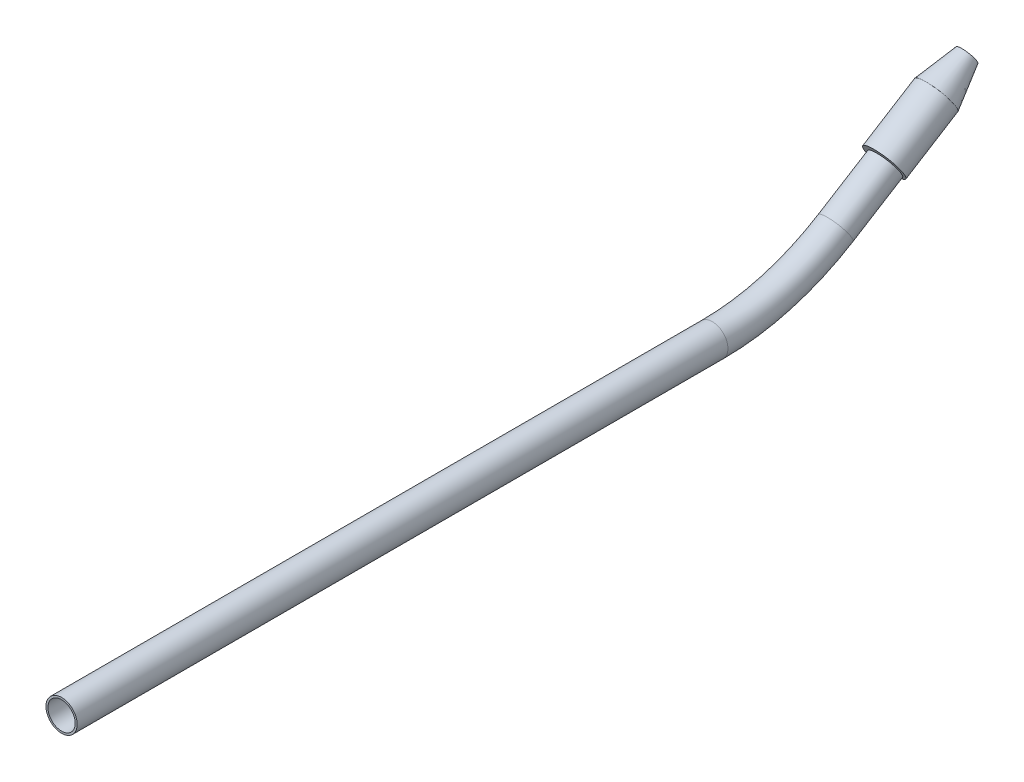
ISO-10303-21;
HEADER;
FILE_DESCRIPTION(('STEP AP214'),'2;1');
FILE_NAME('part.step','',(''),(''),'','','');
FILE_SCHEMA(('AUTOMOTIVE_DESIGN { 1 0 10303 214 1 1 1 1 }'));
ENDSEC;
DATA;
#1=APPLICATION_CONTEXT('core data for automotive mechanical design processes');
#2=APPLICATION_PROTOCOL_DEFINITION('international standard','automotive_design',2000,#1);
#3=PRODUCT_CONTEXT('',#1,'mechanical');
#4=PRODUCT('Part','Part','',(#3));
#5=PRODUCT_RELATED_PRODUCT_CATEGORY('part','',(#4));
#6=PRODUCT_DEFINITION_FORMATION('','',#4);
#7=PRODUCT_DEFINITION_CONTEXT('part definition',#1,'design');
#8=PRODUCT_DEFINITION('design','',#6,#7);
#9=PRODUCT_DEFINITION_SHAPE('','',#8);
#10=(LENGTH_UNIT() NAMED_UNIT(*) SI_UNIT(.MILLI.,.METRE.));
#11=(NAMED_UNIT(*) PLANE_ANGLE_UNIT() SI_UNIT($,.RADIAN.));
#12=(NAMED_UNIT(*) SI_UNIT($,.STERADIAN.) SOLID_ANGLE_UNIT());
#13=UNCERTAINTY_MEASURE_WITH_UNIT(LENGTH_MEASURE(1.E-05),#10,'distance_accuracy_value','');
#14=(GEOMETRIC_REPRESENTATION_CONTEXT(3) GLOBAL_UNCERTAINTY_ASSIGNED_CONTEXT((#13)) GLOBAL_UNIT_ASSIGNED_CONTEXT((#10,
#11,#12)) REPRESENTATION_CONTEXT('',''));
#15=CARTESIAN_POINT('',(0.,0.,0.));
#16=DIRECTION('',(0.,0.,1.));
#17=DIRECTION('',(1.,0.,0.));
#18=AXIS2_PLACEMENT_3D('',#15,#16,#17);
#19=CARTESIAN_POINT('',(0.,-57.1210339456504,7.82934113979381));
#20=DIRECTION('',(0.,-0.528906522491914,0.848680087232822));
#21=DIRECTION('',(0.,-0.848680087232822,-0.528906522491914));
#22=AXIS2_PLACEMENT_3D('',#19,#20,#21);
#23=CYLINDRICAL_SURFACE('',#22,0.62499881796374);
#24=CARTESIAN_POINT('',(0.,8.66642229513749,-97.7327983441465));
#25=DIRECTION('',(0.,-0.528906522491914,0.848680087232822));
#26=DIRECTION('',(0.,-0.848680087232822,-0.528906522491914));
#27=AXIS2_PLACEMENT_3D('',#24,#25,#26);
#28=CIRCLE('',#27,0.62499881796374);
#29=CARTESIAN_POINT('',(0.,8.13599824378761,-98.0633642955173));
#30=VERTEX_POINT('',#29);
#31=EDGE_CURVE('E12',#30,#30,#28,.T.);
#32=ORIENTED_EDGE('',*,*,#31,.T.);
#33=EDGE_LOOP('',(#32));
#34=FACE_BOUND('',#33,.T.);
#35=CARTESIAN_POINT('',(0.,15.2796700478453,-108.344374191646));
#36=DIRECTION('',(0.,-0.528906522491914,0.848680087232822));
#37=DIRECTION('',(0.,-0.848680087232822,-0.528906522491914));
#38=AXIS2_PLACEMENT_3D('',#35,#36,#37);
#39=CIRCLE('',#38,0.624998817963733);
#40=CARTESIAN_POINT('',(0.,14.7492459964954,-108.674940143017));
#41=VERTEX_POINT('',#40);
#42=EDGE_CURVE('E62',#41,#41,#39,.T.);
#43=ORIENTED_EDGE('',*,*,#42,.F.);
#44=EDGE_LOOP('',(#43));
#45=FACE_BOUND('',#44,.T.);
#46=ADVANCED_FACE('F43',(#34,#45),#23,.F.);
#47=CARTESIAN_POINT('',(0.,8.13599824378762,-98.0633642955173));
#48=DIRECTION('',(0.,-0.528906522491914,0.848680087232822));
#49=DIRECTION('',(0.,-0.848680087232822,-0.528906522491914));
#50=AXIS2_PLACEMENT_3D('',#47,#48,#49);
#51=PLANE('',#50);
#52=CARTESIAN_POINT('',(0.,8.66642229513749,-97.7327983441465));
#53=DIRECTION('',(0.,-0.528906522491914,0.848680087232822));
#54=DIRECTION('',(0.,-0.848680087232822,-0.528906522491914));
#55=AXIS2_PLACEMENT_3D('',#52,#53,#54);
#56=CIRCLE('',#55,2.47568441904904);
#57=CARTESIAN_POINT('',(0.,6.56535822641802,-99.0422039810132));
#58=VERTEX_POINT('',#57);
#59=EDGE_CURVE('E49',#58,#58,#56,.T.);
#60=ORIENTED_EDGE('',*,*,#59,.T.);
#61=EDGE_LOOP('',(#60));
#62=FACE_BOUND('',#61,.T.);
#63=ORIENTED_EDGE('',*,*,#31,.F.);
#64=EDGE_LOOP('',(#63));
#65=FACE_BOUND('',#64,.T.);
#66=ADVANCED_FACE('F70',(#62,#65),#51,.T.);
#67=CARTESIAN_POINT('',(0.,-57.1210339456504,7.82934113979381));
#68=DIRECTION('',(0.,-0.528906522491914,0.848680087232822));
#69=DIRECTION('',(0.,-0.848680087232822,-0.528906522491914));
#70=AXIS2_PLACEMENT_3D('',#67,#68,#69);
#71=CYLINDRICAL_SURFACE('',#70,2.47568441904904);
#72=CARTESIAN_POINT('',(0.,12.8264354405282,-104.407929334186));
#73=DIRECTION('',(0.,-0.528906522491914,0.848680087232822));
#74=DIRECTION('',(0.,-0.848680087232822,-0.528906522491914));
#75=AXIS2_PLACEMENT_3D('',#72,#73,#74);
#76=CIRCLE('',#75,2.47568441904905);
#77=CARTESIAN_POINT('',(0.,10.7253713718087,-105.717334971053));
#78=VERTEX_POINT('',#77);
#79=EDGE_CURVE('E53',#78,#78,#76,.T.);
#80=ORIENTED_EDGE('',*,*,#79,.T.);
#81=EDGE_LOOP('',(#80));
#82=FACE_BOUND('',#81,.T.);
#83=ORIENTED_EDGE('',*,*,#59,.F.);
#84=EDGE_LOOP('',(#83));
#85=FACE_BOUND('',#84,.T.);
#86=ADVANCED_FACE('F74',(#82,#85),#71,.T.);
#87=CARTESIAN_POINT('',(0.,12.8264354405282,-104.407929334186));
#88=DIRECTION('',(0.,-0.528906522491914,0.848680087232822));
#89=DIRECTION('',(0.,-0.848680087232822,-0.528906522491914));
#90=AXIS2_PLACEMENT_3D('',#87,#88,#89);
#91=CONICAL_SURFACE('',#90,2.47568441904904,0.258399369340229);
#92=CARTESIAN_POINT('',(0.,15.2796700478453,-108.344374191646));
#93=DIRECTION('',(0.,-0.528906522491914,0.848680087232822));
#94=DIRECTION('',(0.,-0.848680087232822,-0.528906522491914));
#95=AXIS2_PLACEMENT_3D('',#92,#93,#94);
#96=CIRCLE('',#95,1.24973918269446);
#97=CARTESIAN_POINT('',(0.,14.2190412892579,-109.005369396787));
#98=VERTEX_POINT('',#97);
#99=EDGE_CURVE('E57',#98,#98,#96,.T.);
#100=ORIENTED_EDGE('',*,*,#99,.T.);
#101=EDGE_LOOP('',(#100));
#102=FACE_BOUND('',#101,.T.);
#103=ORIENTED_EDGE('',*,*,#79,.F.);
#104=EDGE_LOOP('',(#103));
#105=FACE_BOUND('',#104,.T.);
#106=ADVANCED_FACE('F78',(#102,#105),#91,.T.);
#107=CARTESIAN_POINT('',(0.,14.2190412892579,-109.005369396787));
#108=DIRECTION('',(0.,0.528906522491914,-0.848680087232822));
#109=DIRECTION('',(0.,0.848680087232822,0.528906522491914));
#110=AXIS2_PLACEMENT_3D('',#107,#108,#109);
#111=PLANE('',#110);
#112=ORIENTED_EDGE('',*,*,#42,.T.);
#113=EDGE_LOOP('',(#112));
#114=FACE_BOUND('',#113,.T.);
#115=ORIENTED_EDGE('',*,*,#99,.F.);
#116=EDGE_LOOP('',(#115));
#117=FACE_BOUND('',#116,.T.);
#118=ADVANCED_FACE('F66',(#114,#117),#111,.T.);
#119=CLOSED_SHELL('',(#46,#66,#86,#106,#118));
#120=MANIFOLD_SOLID_BREP('B2',#119);
#121=CARTESIAN_POINT('',(0.,0.,7.82934113979381));
#122=DIRECTION('',(0.,0.,-1.));
#123=DIRECTION('',(0.,1.,0.));
#124=AXIS2_PLACEMENT_3D('',#121,#122,#123);
#125=CYLINDRICAL_SURFACE('',#124,2.);
#126=CARTESIAN_POINT('',(0.,0.,-75.6736475066552));
#127=DIRECTION('',(0.,0.,1.));
#128=DIRECTION('',(1.,0.,0.));
#129=AXIS2_PLACEMENT_3D('',#126,#127,#128);
#130=CIRCLE('',#129,2.);
#131=CARTESIAN_POINT('',(0.,-1.99999999999999,-75.6736475066552));
#132=VERTEX_POINT('',#131);
#133=EDGE_CURVE('E142',#132,#132,#130,.T.);
#134=ORIENTED_EDGE('',*,*,#133,.T.);
#135=EDGE_LOOP('',(#134));
#136=FACE_BOUND('',#135,.T.);
#137=CARTESIAN_POINT('',(0.,0.,7.82934113979381));
#138=DIRECTION('',(0.,0.,1.));
#139=DIRECTION('',(1.,0.,0.));
#140=AXIS2_PLACEMENT_3D('',#137,#138,#139);
#141=CIRCLE('',#140,2.);
#142=CARTESIAN_POINT('',(2.,0.,7.82934113979381));
#143=VERTEX_POINT('',#142);
#144=EDGE_CURVE('E140',#143,#143,#141,.T.);
#145=ORIENTED_EDGE('',*,*,#144,.F.);
#146=EDGE_LOOP('',(#145));
#147=FACE_BOUND('',#146,.T.);
#148=ADVANCED_FACE('F119',(#136,#147),#125,.T.);
#149=CARTESIAN_POINT('',(0.,30.,-75.6736475066553));
#150=DIRECTION('',(1.,0.,0.));
#151=DIRECTION('',(0.,0.,-1.));
#152=AXIS2_PLACEMENT_3D('',#149,#150,#151);
#153=TOROIDAL_SURFACE('',#152,30.,2.);
#154=CARTESIAN_POINT('',(0.,4.50878593052604,-91.4912960444201));
#155=DIRECTION('',(0.,-0.527254951258826,0.849707135649132));
#156=DIRECTION('',(1.,0.,0.));
#157=AXIS2_PLACEMENT_3D('',#154,#155,#156);
#158=CIRCLE('',#157,2.);
#159=CARTESIAN_POINT('',(0.,2.80937165922778,-92.5458059469378));
#160=VERTEX_POINT('',#159);
#161=EDGE_CURVE('E123',#160,#160,#158,.T.);
#162=CARTESIAN_POINT('',(0.,30.,-75.6736475066553));
#163=DIRECTION('',(1.,0.,0.));
#164=DIRECTION('',(0.,0.,-1.));
#165=AXIS2_PLACEMENT_3D('',#162,#163,#164);
#166=CIRCLE('',#165,32.);
#167=EDGE_CURVE('',#132,#160,#166,.T.);
#168=ORIENTED_EDGE('',*,*,#133,.F.);
#169=ORIENTED_EDGE('',*,*,#161,.T.);
#170=ORIENTED_EDGE('',*,*,#167,.T.);
#171=ORIENTED_EDGE('',*,*,#167,.F.);
#172=EDGE_LOOP('',(#168,#170,#169,#171));
#173=FACE_BOUND('',#172,.T.);
#174=ADVANCED_FACE('F149',(#173),#153,.T.);
#175=CARTESIAN_POINT('',(0.,4.50878593052604,-91.4912960444201));
#176=DIRECTION('',(0.,0.527254951258823,-0.849707135649134));
#177=DIRECTION('',(0.,0.849707135649134,0.527254951258823));
#178=AXIS2_PLACEMENT_3D('',#175,#176,#177);
#179=CYLINDRICAL_SURFACE('',#178,2.);
#180=CARTESIAN_POINT('',(0.,8.45112715560377,-97.8446464721677));
#181=DIRECTION('',(0.,-0.527254951258823,0.849707135649134));
#182=DIRECTION('',(1.,0.,0.));
#183=AXIS2_PLACEMENT_3D('',#180,#181,#182);
#184=CIRCLE('',#183,2.);
#185=CARTESIAN_POINT('',(2.,8.45112715560377,-97.8446464721677));
#186=VERTEX_POINT('',#185);
#187=EDGE_CURVE('E136',#186,#186,#184,.T.);
#188=ORIENTED_EDGE('',*,*,#187,.T.);
#189=EDGE_LOOP('',(#188));
#190=FACE_BOUND('',#189,.T.);
#191=ORIENTED_EDGE('',*,*,#161,.F.);
#192=EDGE_LOOP('',(#191));
#193=FACE_BOUND('',#192,.T.);
#194=ADVANCED_FACE('F121',(#190,#193),#179,.T.);
#195=CARTESIAN_POINT('',(0.,0.,7.82934113979381));
#196=DIRECTION('',(0.,0.,1.));
#197=DIRECTION('',(1.,0.,0.));
#198=AXIS2_PLACEMENT_3D('',#195,#196,#197);
#199=PLANE('',#198);
#200=CARTESIAN_POINT('',(0.,0.,7.82934113979381));
#201=DIRECTION('',(0.,0.,1.));
#202=DIRECTION('',(1.,0.,0.));
#203=AXIS2_PLACEMENT_3D('',#200,#201,#202);
#204=CIRCLE('',#203,1.75);
#205=CARTESIAN_POINT('',(1.75,0.,7.82934113979381));
#206=VERTEX_POINT('',#205);
#207=EDGE_CURVE('E139',#206,#206,#204,.F.);
#208=ORIENTED_EDGE('',*,*,#207,.T.);
#209=EDGE_LOOP('',(#208));
#210=FACE_BOUND('',#209,.T.);
#211=ORIENTED_EDGE('',*,*,#144,.T.);
#212=EDGE_LOOP('',(#211));
#213=FACE_BOUND('',#212,.T.);
#214=ADVANCED_FACE('F153',(#210,#213),#199,.T.);
#215=CARTESIAN_POINT('',(0.,8.45112715560377,-97.8446464721677));
#216=DIRECTION('',(0.,-0.527254951258823,0.849707135649134));
#217=DIRECTION('',(1.,0.,0.));
#218=AXIS2_PLACEMENT_3D('',#215,#216,#217);
#219=PLANE('',#218);
#220=CARTESIAN_POINT('',(0.,8.45112715560377,-97.8446464721677));
#221=DIRECTION('',(0.,-0.527254951258823,0.849707135649134));
#222=DIRECTION('',(1.,0.,0.));
#223=AXIS2_PLACEMENT_3D('',#220,#221,#222);
#224=CIRCLE('',#223,1.75);
#225=CARTESIAN_POINT('',(1.75,8.45112715560377,-97.8446464721677));
#226=VERTEX_POINT('',#225);
#227=EDGE_CURVE('E42',#226,#226,#224,.F.);
#228=ORIENTED_EDGE('',*,*,#227,.F.);
#229=EDGE_LOOP('',(#228));
#230=FACE_BOUND('',#229,.T.);
#231=ORIENTED_EDGE('',*,*,#187,.F.);
#232=EDGE_LOOP('',(#231));
#233=FACE_BOUND('',#232,.T.);
#234=ADVANCED_FACE('F159',(#230,#233),#219,.F.);
#235=CARTESIAN_POINT('',(0.,0.,7.82934113979381));
#236=DIRECTION('',(0.,0.,-1.));
#237=DIRECTION('',(0.,1.,0.));
#238=AXIS2_PLACEMENT_3D('',#235,#236,#237);
#239=CYLINDRICAL_SURFACE('',#238,1.75);
#240=CARTESIAN_POINT('',(0.,0.,-75.6736475066552));
#241=DIRECTION('',(0.,0.,1.));
#242=DIRECTION('',(1.,0.,0.));
#243=AXIS2_PLACEMENT_3D('',#240,#241,#242);
#244=CIRCLE('',#243,1.75);
#245=CARTESIAN_POINT('',(0.,-1.74999999999999,-75.6736475066552));
#246=VERTEX_POINT('',#245);
#247=EDGE_CURVE('E132',#246,#246,#244,.F.);
#248=ORIENTED_EDGE('',*,*,#247,.T.);
#249=EDGE_LOOP('',(#248));
#250=FACE_BOUND('',#249,.T.);
#251=ORIENTED_EDGE('',*,*,#207,.F.);
#252=EDGE_LOOP('',(#251));
#253=FACE_BOUND('',#252,.T.);
#254=ADVANCED_FACE('F169',(#250,#253),#239,.F.);
#255=CARTESIAN_POINT('',(0.,30.,-75.6736475066553));
#256=DIRECTION('',(1.,0.,0.));
#257=DIRECTION('',(0.,0.,-1.));
#258=AXIS2_PLACEMENT_3D('',#255,#256,#257);
#259=TOROIDAL_SURFACE('',#258,30.,1.75);
#260=CARTESIAN_POINT('',(0.,4.50878593052604,-91.4912960444201));
#261=DIRECTION('',(0.,-0.527254951258826,0.849707135649132));
#262=DIRECTION('',(1.,0.,0.));
#263=AXIS2_PLACEMENT_3D('',#260,#261,#262);
#264=CIRCLE('',#263,1.75);
#265=CARTESIAN_POINT('',(0.,3.02179844314006,-92.4139922091231));
#266=VERTEX_POINT('',#265);
#267=EDGE_CURVE('E127',#266,#266,#264,.F.);
#268=CARTESIAN_POINT('',(0.,30.,-75.6736475066553));
#269=DIRECTION('',(1.,0.,0.));
#270=DIRECTION('',(0.,0.,-1.));
#271=AXIS2_PLACEMENT_3D('',#268,#269,#270);
#272=CIRCLE('',#271,31.75);
#273=EDGE_CURVE('',#246,#266,#272,.T.);
#274=ORIENTED_EDGE('',*,*,#247,.F.);
#275=ORIENTED_EDGE('',*,*,#267,.T.);
#276=ORIENTED_EDGE('',*,*,#273,.T.);
#277=ORIENTED_EDGE('',*,*,#273,.F.);
#278=EDGE_LOOP('',(#274,#276,#275,#277));
#279=FACE_BOUND('',#278,.T.);
#280=ADVANCED_FACE('F164',(#279),#259,.F.);
#281=CARTESIAN_POINT('',(0.,4.50878593052604,-91.4912960444201));
#282=DIRECTION('',(0.,0.527254951258823,-0.849707135649134));
#283=DIRECTION('',(0.,0.849707135649134,0.527254951258823));
#284=AXIS2_PLACEMENT_3D('',#281,#282,#283);
#285=CYLINDRICAL_SURFACE('',#284,1.75);
#286=ORIENTED_EDGE('',*,*,#227,.T.);
#287=EDGE_LOOP('',(#286));
#288=FACE_BOUND('',#287,.T.);
#289=ORIENTED_EDGE('',*,*,#267,.F.);
#290=EDGE_LOOP('',(#289));
#291=FACE_BOUND('',#290,.T.);
#292=ADVANCED_FACE('F162',(#288,#291),#285,.F.);
#293=CLOSED_SHELL('',(#148,#174,#194,#214,#234,#254,#280,#292));
#294=MANIFOLD_SOLID_BREP('B7',#293);
#295=ADVANCED_BREP_SHAPE_REPRESENTATION('',(#18,#120,#294),#14);
#296=SHAPE_DEFINITION_REPRESENTATION(#9,#295);
ENDSEC;
END-ISO-10303-21;
